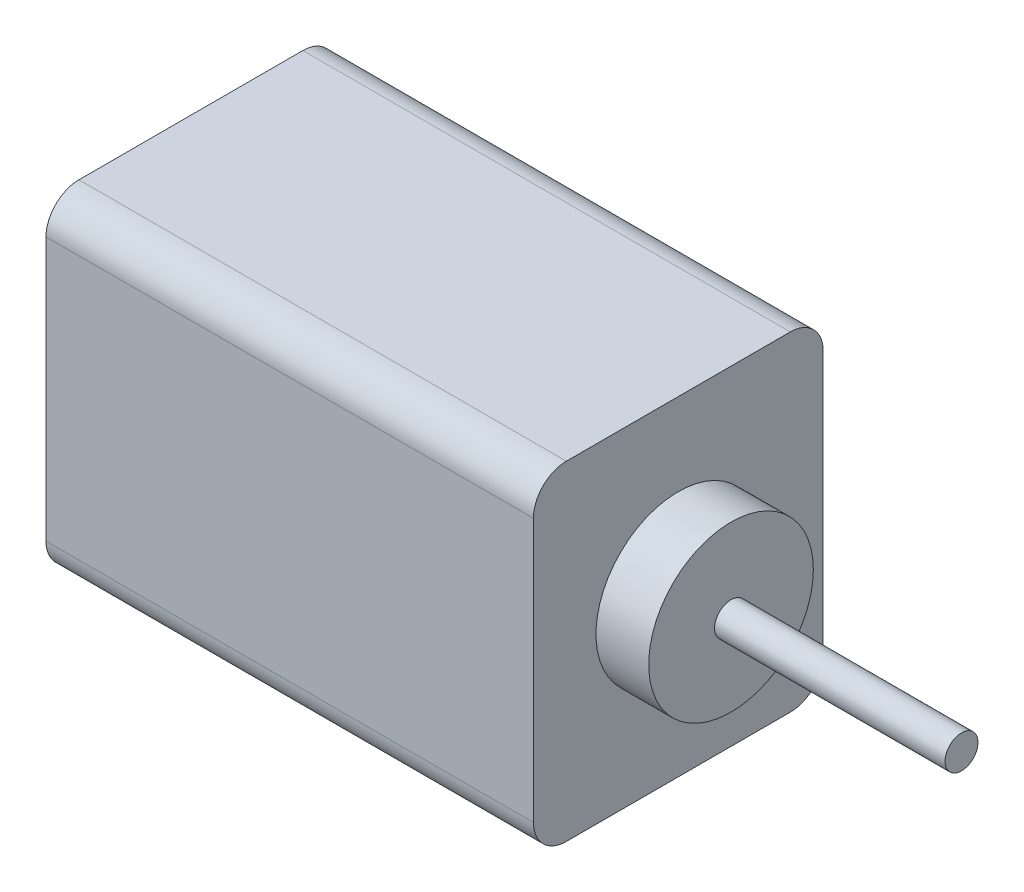
ISO-10303-21;
HEADER;
FILE_DESCRIPTION(('STEP AP214'),'2;1');
FILE_NAME('part.step','',(''),(''),'','','');
FILE_SCHEMA(('AUTOMOTIVE_DESIGN { 1 0 10303 214 1 1 1 1 }'));
ENDSEC;
DATA;
#1=APPLICATION_CONTEXT('core data for automotive mechanical design processes');
#2=APPLICATION_PROTOCOL_DEFINITION('international standard','automotive_design',2000,#1);
#3=PRODUCT_CONTEXT('',#1,'mechanical');
#4=PRODUCT('Part','Part','',(#3));
#5=PRODUCT_RELATED_PRODUCT_CATEGORY('part','',(#4));
#6=PRODUCT_DEFINITION_FORMATION('','',#4);
#7=PRODUCT_DEFINITION_CONTEXT('part definition',#1,'design');
#8=PRODUCT_DEFINITION('design','',#6,#7);
#9=PRODUCT_DEFINITION_SHAPE('','',#8);
#10=(LENGTH_UNIT() NAMED_UNIT(*) SI_UNIT(.MILLI.,.METRE.));
#11=(NAMED_UNIT(*) PLANE_ANGLE_UNIT() SI_UNIT($,.RADIAN.));
#12=(NAMED_UNIT(*) SI_UNIT($,.STERADIAN.) SOLID_ANGLE_UNIT());
#13=UNCERTAINTY_MEASURE_WITH_UNIT(LENGTH_MEASURE(1.E-05),#10,'distance_accuracy_value','');
#14=(GEOMETRIC_REPRESENTATION_CONTEXT(3) GLOBAL_UNCERTAINTY_ASSIGNED_CONTEXT((#13)) GLOBAL_UNIT_ASSIGNED_CONTEXT((#10,
#11,#12)) REPRESENTATION_CONTEXT('',''));
#15=CARTESIAN_POINT('',(0.,0.,0.));
#16=DIRECTION('',(0.,0.,1.));
#17=DIRECTION('',(1.,0.,0.));
#18=AXIS2_PLACEMENT_3D('',#15,#16,#17);
#19=CARTESIAN_POINT('',(37.,50.,-22.));
#20=DIRECTION('',(-1.,0.,0.));
#21=DIRECTION('',(0.,0.,1.));
#22=AXIS2_PLACEMENT_3D('',#19,#20,#21);
#23=PLANE('',#22);
#24=CARTESIAN_POINT('',(37.,25.,0.));
#25=DIRECTION('',(1.,0.,0.));
#26=DIRECTION('',(0.,0.,-1.));
#27=AXIS2_PLACEMENT_3D('',#24,#25,#26);
#28=CIRCLE('',#27,12.5);
#29=CARTESIAN_POINT('',(37.,25.,-12.5));
#30=VERTEX_POINT('',#29);
#31=EDGE_CURVE('E128',#30,#30,#28,.T.);
#32=ORIENTED_EDGE('',*,*,#31,.F.);
#33=EDGE_LOOP('',(#32));
#34=FACE_BOUND('',#33,.T.);
#35=DIRECTION('',(0.,-1.,0.));
#36=VECTOR('',#35,1.);
#37=CARTESIAN_POINT('',(37.,50.,22.));
#38=LINE('',#37,#36);
#39=CARTESIAN_POINT('',(37.,45.,22.));
#40=VERTEX_POINT('',#39);
#41=CARTESIAN_POINT('',(37.,5.,22.));
#42=VERTEX_POINT('',#41);
#43=EDGE_CURVE('E102',#40,#42,#38,.T.);
#44=ORIENTED_EDGE('',*,*,#43,.T.);
#45=CARTESIAN_POINT('',(37.,5.,17.));
#46=DIRECTION('',(-1.,0.,0.));
#47=DIRECTION('',(0.,0.,1.));
#48=AXIS2_PLACEMENT_3D('',#45,#46,#47);
#49=CIRCLE('',#48,5.);
#50=CARTESIAN_POINT('',(37.,0.,17.));
#51=VERTEX_POINT('',#50);
#52=EDGE_CURVE('E137',#42,#51,#49,.F.);
#53=ORIENTED_EDGE('',*,*,#52,.T.);
#54=DIRECTION('',(0.,0.,-1.));
#55=VECTOR('',#54,1.);
#56=CARTESIAN_POINT('',(37.,0.,-22.));
#57=LINE('',#56,#55);
#58=CARTESIAN_POINT('',(37.,0.,-17.));
#59=VERTEX_POINT('',#58);
#60=EDGE_CURVE('E160',#51,#59,#57,.T.);
#61=ORIENTED_EDGE('',*,*,#60,.T.);
#62=CARTESIAN_POINT('',(37.,5.,-17.));
#63=DIRECTION('',(-1.,0.,0.));
#64=DIRECTION('',(0.,0.,1.));
#65=AXIS2_PLACEMENT_3D('',#62,#63,#64);
#66=CIRCLE('',#65,5.);
#67=CARTESIAN_POINT('',(37.,5.,-22.));
#68=VERTEX_POINT('',#67);
#69=EDGE_CURVE('E135',#59,#68,#66,.F.);
#70=ORIENTED_EDGE('',*,*,#69,.T.);
#71=DIRECTION('',(0.,-1.,0.));
#72=VECTOR('',#71,1.);
#73=CARTESIAN_POINT('',(37.,50.,-22.));
#74=LINE('',#73,#72);
#75=CARTESIAN_POINT('',(37.,45.,-22.));
#76=VERTEX_POINT('',#75);
#77=EDGE_CURVE('E131',#76,#68,#74,.T.);
#78=ORIENTED_EDGE('',*,*,#77,.F.);
#79=CARTESIAN_POINT('',(37.,45.,-17.));
#80=DIRECTION('',(-1.,0.,0.));
#81=DIRECTION('',(0.,0.,1.));
#82=AXIS2_PLACEMENT_3D('',#79,#80,#81);
#83=CIRCLE('',#82,5.);
#84=CARTESIAN_POINT('',(37.,50.,-17.));
#85=VERTEX_POINT('',#84);
#86=EDGE_CURVE('E109',#76,#85,#83,.F.);
#87=ORIENTED_EDGE('',*,*,#86,.T.);
#88=DIRECTION('',(0.,0.,-1.));
#89=VECTOR('',#88,1.);
#90=CARTESIAN_POINT('',(37.,50.,-22.));
#91=LINE('',#90,#89);
#92=CARTESIAN_POINT('',(37.,50.,17.));
#93=VERTEX_POINT('',#92);
#94=EDGE_CURVE('E104',#93,#85,#91,.T.);
#95=ORIENTED_EDGE('',*,*,#94,.F.);
#96=CARTESIAN_POINT('',(37.,45.,17.));
#97=DIRECTION('',(-1.,0.,0.));
#98=DIRECTION('',(0.,0.,1.));
#99=AXIS2_PLACEMENT_3D('',#96,#97,#98);
#100=CIRCLE('',#99,5.);
#101=EDGE_CURVE('E100',#93,#40,#100,.F.);
#102=ORIENTED_EDGE('',*,*,#101,.T.);
#103=EDGE_LOOP('',(#44,#53,#61,#70,#78,#87,#95,#102));
#104=FACE_BOUND('',#103,.T.);
#105=ADVANCED_FACE('F33',(#34,#104),#23,.F.);
#106=CARTESIAN_POINT('',(-37.,50.,-22.));
#107=DIRECTION('',(0.,0.,1.));
#108=DIRECTION('',(1.,0.,0.));
#109=AXIS2_PLACEMENT_3D('',#106,#107,#108);
#110=PLANE('',#109);
#111=ORIENTED_EDGE('',*,*,#77,.T.);
#112=DIRECTION('',(-1.,0.,0.));
#113=VECTOR('',#112,1.);
#114=CARTESIAN_POINT('',(-37.,5.,-22.));
#115=LINE('',#114,#113);
#116=CARTESIAN_POINT('',(-37.,5.,-22.));
#117=VERTEX_POINT('',#116);
#118=EDGE_CURVE('E150',#68,#117,#115,.T.);
#119=ORIENTED_EDGE('',*,*,#118,.T.);
#120=DIRECTION('',(0.,-1.,0.));
#121=VECTOR('',#120,1.);
#122=CARTESIAN_POINT('',(-37.,50.,-22.));
#123=LINE('',#122,#121);
#124=CARTESIAN_POINT('',(-37.,45.,-22.));
#125=VERTEX_POINT('',#124);
#126=EDGE_CURVE('E166',#125,#117,#123,.T.);
#127=ORIENTED_EDGE('',*,*,#126,.F.);
#128=DIRECTION('',(-1.,0.,0.));
#129=VECTOR('',#128,1.);
#130=CARTESIAN_POINT('',(37.,45.,-22.));
#131=LINE('',#130,#129);
#132=EDGE_CURVE('E148',#125,#76,#131,.F.);
#133=ORIENTED_EDGE('',*,*,#132,.T.);
#134=EDGE_LOOP('',(#111,#119,#127,#133));
#135=FACE_BOUND('',#134,.T.);
#136=ADVANCED_FACE('F205',(#135),#110,.F.);
#137=CARTESIAN_POINT('',(-37.,50.,-22.));
#138=DIRECTION('',(1.,0.,0.));
#139=DIRECTION('',(0.,0.,-1.));
#140=AXIS2_PLACEMENT_3D('',#137,#138,#139);
#141=PLANE('',#140);
#142=DIRECTION('',(0.,0.,1.));
#143=VECTOR('',#142,1.);
#144=CARTESIAN_POINT('',(-37.,0.,-22.));
#145=LINE('',#144,#143);
#146=CARTESIAN_POINT('',(-37.,0.,-17.));
#147=VERTEX_POINT('',#146);
#148=CARTESIAN_POINT('',(-37.,0.,17.));
#149=VERTEX_POINT('',#148);
#150=EDGE_CURVE('E156',#147,#149,#145,.T.);
#151=ORIENTED_EDGE('',*,*,#150,.T.);
#152=CARTESIAN_POINT('',(-37.,5.,17.));
#153=DIRECTION('',(1.,0.,0.));
#154=DIRECTION('',(0.,0.,-1.));
#155=AXIS2_PLACEMENT_3D('',#152,#153,#154);
#156=CIRCLE('',#155,5.);
#157=CARTESIAN_POINT('',(-37.,5.,22.));
#158=VERTEX_POINT('',#157);
#159=EDGE_CURVE('E146',#149,#158,#156,.F.);
#160=ORIENTED_EDGE('',*,*,#159,.T.);
#161=DIRECTION('',(0.,-1.,0.));
#162=VECTOR('',#161,1.);
#163=CARTESIAN_POINT('',(-37.,50.,22.));
#164=LINE('',#163,#162);
#165=CARTESIAN_POINT('',(-37.,45.,22.));
#166=VERTEX_POINT('',#165);
#167=EDGE_CURVE('E119',#166,#158,#164,.T.);
#168=ORIENTED_EDGE('',*,*,#167,.F.);
#169=CARTESIAN_POINT('',(-37.,45.,17.));
#170=DIRECTION('',(1.,0.,0.));
#171=DIRECTION('',(0.,0.,-1.));
#172=AXIS2_PLACEMENT_3D('',#169,#170,#171);
#173=CIRCLE('',#172,5.);
#174=CARTESIAN_POINT('',(-37.,50.,17.));
#175=VERTEX_POINT('',#174);
#176=EDGE_CURVE('E123',#166,#175,#173,.F.);
#177=ORIENTED_EDGE('',*,*,#176,.T.);
#178=DIRECTION('',(0.,0.,1.));
#179=VECTOR('',#178,1.);
#180=CARTESIAN_POINT('',(-37.,50.,-22.));
#181=LINE('',#180,#179);
#182=CARTESIAN_POINT('',(-37.,50.,-17.));
#183=VERTEX_POINT('',#182);
#184=EDGE_CURVE('E120',#183,#175,#181,.T.);
#185=ORIENTED_EDGE('',*,*,#184,.F.);
#186=CARTESIAN_POINT('',(-37.,45.,-17.));
#187=DIRECTION('',(1.,0.,0.));
#188=DIRECTION('',(0.,0.,-1.));
#189=AXIS2_PLACEMENT_3D('',#186,#187,#188);
#190=CIRCLE('',#189,5.);
#191=EDGE_CURVE('E56',#183,#125,#190,.F.);
#192=ORIENTED_EDGE('',*,*,#191,.T.);
#193=ORIENTED_EDGE('',*,*,#126,.T.);
#194=CARTESIAN_POINT('',(-37.,5.,-17.));
#195=DIRECTION('',(1.,0.,0.));
#196=DIRECTION('',(0.,0.,-1.));
#197=AXIS2_PLACEMENT_3D('',#194,#195,#196);
#198=CIRCLE('',#197,5.);
#199=EDGE_CURVE('E48',#117,#147,#198,.F.);
#200=ORIENTED_EDGE('',*,*,#199,.T.);
#201=EDGE_LOOP('',(#151,#160,#168,#177,#185,#192,#193,#200));
#202=FACE_BOUND('',#201,.T.);
#203=ADVANCED_FACE('F211',(#202),#141,.F.);
#204=CARTESIAN_POINT('',(-37.,50.,22.));
#205=DIRECTION('',(0.,0.,-1.));
#206=DIRECTION('',(-1.,0.,0.));
#207=AXIS2_PLACEMENT_3D('',#204,#205,#206);
#208=PLANE('',#207);
#209=ORIENTED_EDGE('',*,*,#167,.T.);
#210=DIRECTION('',(1.,0.,0.));
#211=VECTOR('',#210,1.);
#212=CARTESIAN_POINT('',(-37.,5.,22.));
#213=LINE('',#212,#211);
#214=EDGE_CURVE('E110',#158,#42,#213,.T.);
#215=ORIENTED_EDGE('',*,*,#214,.T.);
#216=ORIENTED_EDGE('',*,*,#43,.F.);
#217=DIRECTION('',(1.,0.,0.));
#218=VECTOR('',#217,1.);
#219=CARTESIAN_POINT('',(-37.,45.,22.));
#220=LINE('',#219,#218);
#221=EDGE_CURVE('E116',#40,#166,#220,.F.);
#222=ORIENTED_EDGE('',*,*,#221,.T.);
#223=EDGE_LOOP('',(#209,#215,#216,#222));
#224=FACE_BOUND('',#223,.T.);
#225=ADVANCED_FACE('F115',(#224),#208,.F.);
#226=CARTESIAN_POINT('',(0.,50.,0.));
#227=DIRECTION('',(0.,1.,0.));
#228=DIRECTION('',(0.,0.,1.));
#229=AXIS2_PLACEMENT_3D('',#226,#227,#228);
#230=PLANE('',#229);
#231=ORIENTED_EDGE('',*,*,#94,.T.);
#232=DIRECTION('',(-1.,0.,0.));
#233=VECTOR('',#232,1.);
#234=CARTESIAN_POINT('',(-37.,50.,-17.));
#235=LINE('',#234,#233);
#236=EDGE_CURVE('E11',#85,#183,#235,.T.);
#237=ORIENTED_EDGE('',*,*,#236,.T.);
#238=ORIENTED_EDGE('',*,*,#184,.T.);
#239=DIRECTION('',(1.,0.,0.));
#240=VECTOR('',#239,1.);
#241=CARTESIAN_POINT('',(37.,50.,17.));
#242=LINE('',#241,#240);
#243=EDGE_CURVE('E41',#175,#93,#242,.T.);
#244=ORIENTED_EDGE('',*,*,#243,.T.);
#245=EDGE_LOOP('',(#231,#237,#238,#244));
#246=FACE_BOUND('',#245,.T.);
#247=ADVANCED_FACE('F153',(#246),#230,.T.);
#248=CARTESIAN_POINT('',(0.,0.,0.));
#249=DIRECTION('',(0.,1.,0.));
#250=DIRECTION('',(0.,0.,1.));
#251=AXIS2_PLACEMENT_3D('',#248,#249,#250);
#252=PLANE('',#251);
#253=ORIENTED_EDGE('',*,*,#60,.F.);
#254=DIRECTION('',(1.,0.,0.));
#255=VECTOR('',#254,1.);
#256=CARTESIAN_POINT('',(0.,0.,17.));
#257=LINE('',#256,#255);
#258=EDGE_CURVE('E141',#51,#149,#257,.F.);
#259=ORIENTED_EDGE('',*,*,#258,.T.);
#260=ORIENTED_EDGE('',*,*,#150,.F.);
#261=DIRECTION('',(-1.,0.,0.));
#262=VECTOR('',#261,1.);
#263=CARTESIAN_POINT('',(0.,0.,-17.));
#264=LINE('',#263,#262);
#265=EDGE_CURVE('E139',#147,#59,#264,.F.);
#266=ORIENTED_EDGE('',*,*,#265,.T.);
#267=EDGE_LOOP('',(#253,#259,#260,#266));
#268=FACE_BOUND('',#267,.T.);
#269=ADVANCED_FACE('F196',(#268),#252,.F.);
#270=CARTESIAN_POINT('',(45.,25.,0.));
#271=DIRECTION('',(-1.,0.,0.));
#272=DIRECTION('',(0.,0.,1.));
#273=AXIS2_PLACEMENT_3D('',#270,#271,#272);
#274=CYLINDRICAL_SURFACE('',#273,12.5);
#275=CARTESIAN_POINT('',(45.,25.,0.));
#276=DIRECTION('',(1.,0.,0.));
#277=DIRECTION('',(0.,0.,-1.));
#278=AXIS2_PLACEMENT_3D('',#275,#276,#277);
#279=CIRCLE('',#278,12.5);
#280=CARTESIAN_POINT('',(45.,25.,-12.5));
#281=VERTEX_POINT('',#280);
#282=EDGE_CURVE('E163',#281,#281,#279,.T.);
#283=ORIENTED_EDGE('',*,*,#282,.F.);
#284=EDGE_LOOP('',(#283));
#285=FACE_BOUND('',#284,.T.);
#286=ORIENTED_EDGE('',*,*,#31,.T.);
#287=EDGE_LOOP('',(#286));
#288=FACE_BOUND('',#287,.T.);
#289=ADVANCED_FACE('F191',(#285,#288),#274,.T.);
#290=CARTESIAN_POINT('',(45.,25.,0.));
#291=DIRECTION('',(1.,0.,0.));
#292=DIRECTION('',(0.,0.,-1.));
#293=AXIS2_PLACEMENT_3D('',#290,#291,#292);
#294=PLANE('',#293);
#295=CARTESIAN_POINT('',(45.,24.7839730107525,0.));
#296=DIRECTION('',(1.,0.,0.));
#297=DIRECTION('',(0.,0.,-1.));
#298=AXIS2_PLACEMENT_3D('',#295,#296,#297);
#299=CIRCLE('',#298,2.5);
#300=CARTESIAN_POINT('',(45.,24.7839730107525,-2.50000000000001));
#301=VERTEX_POINT('',#300);
#302=EDGE_CURVE('E124',#301,#301,#299,.T.);
#303=ORIENTED_EDGE('',*,*,#302,.F.);
#304=EDGE_LOOP('',(#303));
#305=FACE_BOUND('',#304,.T.);
#306=ORIENTED_EDGE('',*,*,#282,.T.);
#307=EDGE_LOOP('',(#306));
#308=FACE_BOUND('',#307,.T.);
#309=ADVANCED_FACE('F185',(#305,#308),#294,.T.);
#310=CARTESIAN_POINT('',(80.,24.7839730107525,0.));
#311=DIRECTION('',(-1.,0.,0.));
#312=DIRECTION('',(0.,0.,1.));
#313=AXIS2_PLACEMENT_3D('',#310,#311,#312);
#314=CYLINDRICAL_SURFACE('',#313,2.5);
#315=CARTESIAN_POINT('',(80.,24.7839730107525,0.));
#316=DIRECTION('',(1.,0.,0.));
#317=DIRECTION('',(0.,0.,-1.));
#318=AXIS2_PLACEMENT_3D('',#315,#316,#317);
#319=CIRCLE('',#318,2.5);
#320=CARTESIAN_POINT('',(80.,24.7839730107525,-2.50000000000001));
#321=VERTEX_POINT('',#320);
#322=EDGE_CURVE('E175',#321,#321,#319,.T.);
#323=ORIENTED_EDGE('',*,*,#322,.F.);
#324=EDGE_LOOP('',(#323));
#325=FACE_BOUND('',#324,.T.);
#326=ORIENTED_EDGE('',*,*,#302,.T.);
#327=EDGE_LOOP('',(#326));
#328=FACE_BOUND('',#327,.T.);
#329=ADVANCED_FACE('F182',(#325,#328),#314,.T.);
#330=CARTESIAN_POINT('',(80.,24.7839730107525,0.));
#331=DIRECTION('',(1.,0.,0.));
#332=DIRECTION('',(0.,0.,-1.));
#333=AXIS2_PLACEMENT_3D('',#330,#331,#332);
#334=PLANE('',#333);
#335=ORIENTED_EDGE('',*,*,#322,.T.);
#336=EDGE_LOOP('',(#335));
#337=FACE_BOUND('',#336,.T.);
#338=ADVANCED_FACE('F180',(#337),#334,.T.);
#339=CARTESIAN_POINT('',(-37.,5.,17.));
#340=DIRECTION('',(1.,0.,0.));
#341=DIRECTION('',(0.,0.,-1.));
#342=AXIS2_PLACEMENT_3D('',#339,#340,#341);
#343=CYLINDRICAL_SURFACE('',#342,5.);
#344=ORIENTED_EDGE('',*,*,#159,.F.);
#345=ORIENTED_EDGE('',*,*,#258,.F.);
#346=ORIENTED_EDGE('',*,*,#52,.F.);
#347=ORIENTED_EDGE('',*,*,#214,.F.);
#348=EDGE_LOOP('',(#344,#345,#346,#347));
#349=FACE_BOUND('',#348,.T.);
#350=ADVANCED_FACE('F215',(#349),#343,.T.);
#351=CARTESIAN_POINT('',(-37.,5.,-17.));
#352=DIRECTION('',(-1.,0.,0.));
#353=DIRECTION('',(0.,0.,1.));
#354=AXIS2_PLACEMENT_3D('',#351,#352,#353);
#355=CYLINDRICAL_SURFACE('',#354,5.);
#356=ORIENTED_EDGE('',*,*,#69,.F.);
#357=ORIENTED_EDGE('',*,*,#265,.F.);
#358=ORIENTED_EDGE('',*,*,#199,.F.);
#359=ORIENTED_EDGE('',*,*,#118,.F.);
#360=EDGE_LOOP('',(#356,#357,#358,#359));
#361=FACE_BOUND('',#360,.T.);
#362=ADVANCED_FACE('F218',(#361),#355,.T.);
#363=CARTESIAN_POINT('',(0.,45.,-17.));
#364=DIRECTION('',(1.,0.,0.));
#365=DIRECTION('',(0.,0.,-1.));
#366=AXIS2_PLACEMENT_3D('',#363,#364,#365);
#367=CYLINDRICAL_SURFACE('',#366,5.);
#368=ORIENTED_EDGE('',*,*,#86,.F.);
#369=ORIENTED_EDGE('',*,*,#132,.F.);
#370=ORIENTED_EDGE('',*,*,#191,.F.);
#371=ORIENTED_EDGE('',*,*,#236,.F.);
#372=EDGE_LOOP('',(#368,#369,#370,#371));
#373=FACE_BOUND('',#372,.T.);
#374=ADVANCED_FACE('F221',(#373),#367,.T.);
#375=CARTESIAN_POINT('',(0.,45.,17.));
#376=DIRECTION('',(-1.,0.,0.));
#377=DIRECTION('',(0.,0.,1.));
#378=AXIS2_PLACEMENT_3D('',#375,#376,#377);
#379=CYLINDRICAL_SURFACE('',#378,5.);
#380=ORIENTED_EDGE('',*,*,#176,.F.);
#381=ORIENTED_EDGE('',*,*,#221,.F.);
#382=ORIENTED_EDGE('',*,*,#101,.F.);
#383=ORIENTED_EDGE('',*,*,#243,.F.);
#384=EDGE_LOOP('',(#380,#381,#382,#383));
#385=FACE_BOUND('',#384,.T.);
#386=ADVANCED_FACE('F35',(#385),#379,.T.);
#387=CLOSED_SHELL('',(#105,#136,#203,#225,#247,#269,#289,#309,#329,#338,#350,#362,#374,#386));
#388=MANIFOLD_SOLID_BREP('B2',#387);
#389=ADVANCED_BREP_SHAPE_REPRESENTATION('',(#18,#388),#14);
#390=SHAPE_DEFINITION_REPRESENTATION(#9,#389);
ENDSEC;
END-ISO-10303-21;
